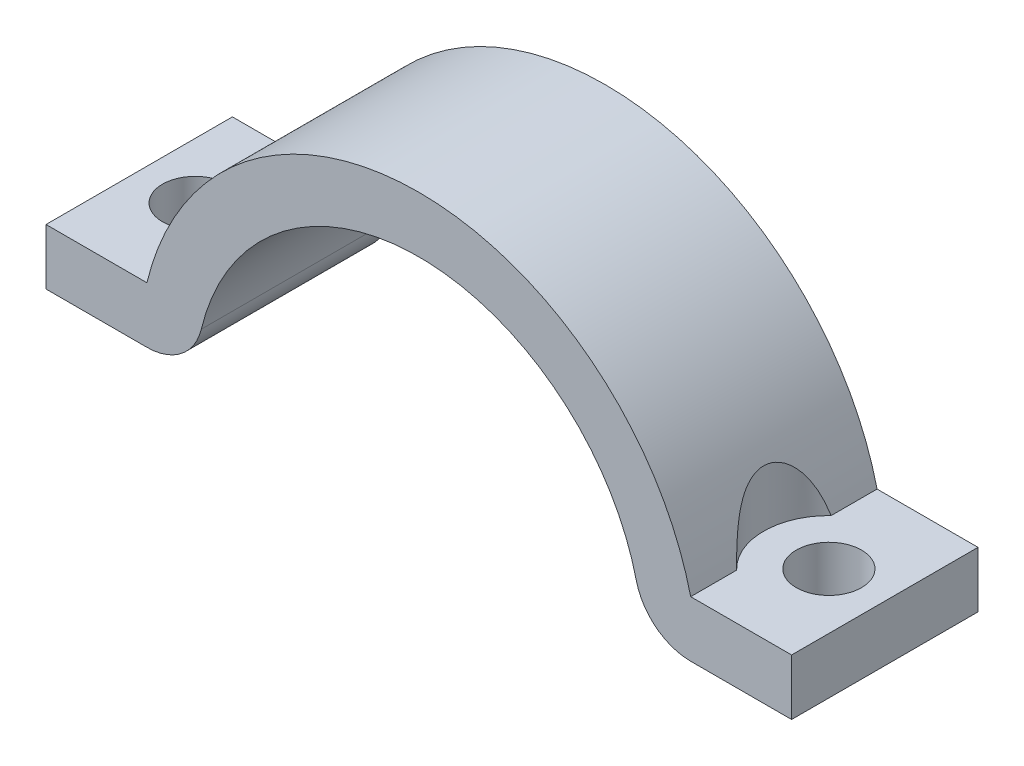
ISO-10303-21;
HEADER;
FILE_DESCRIPTION(('STEP AP214'),'2;1');
FILE_NAME('part.step','',(''),(''),'','','');
FILE_SCHEMA(('AUTOMOTIVE_DESIGN { 1 0 10303 214 1 1 1 1 }'));
ENDSEC;
DATA;
#1=APPLICATION_CONTEXT('core data for automotive mechanical design processes');
#2=APPLICATION_PROTOCOL_DEFINITION('international standard','automotive_design',2000,#1);
#3=PRODUCT_CONTEXT('',#1,'mechanical');
#4=PRODUCT('Part','Part','',(#3));
#5=PRODUCT_RELATED_PRODUCT_CATEGORY('part','',(#4));
#6=PRODUCT_DEFINITION_FORMATION('','',#4);
#7=PRODUCT_DEFINITION_CONTEXT('part definition',#1,'design');
#8=PRODUCT_DEFINITION('design','',#6,#7);
#9=PRODUCT_DEFINITION_SHAPE('','',#8);
#10=(LENGTH_UNIT() NAMED_UNIT(*) SI_UNIT(.MILLI.,.METRE.));
#11=(NAMED_UNIT(*) PLANE_ANGLE_UNIT() SI_UNIT($,.RADIAN.));
#12=(NAMED_UNIT(*) SI_UNIT($,.STERADIAN.) SOLID_ANGLE_UNIT());
#13=UNCERTAINTY_MEASURE_WITH_UNIT(LENGTH_MEASURE(1.E-05),#10,'distance_accuracy_value','');
#14=(GEOMETRIC_REPRESENTATION_CONTEXT(3) GLOBAL_UNCERTAINTY_ASSIGNED_CONTEXT((#13)) GLOBAL_UNIT_ASSIGNED_CONTEXT((#10,
#11,#12)) REPRESENTATION_CONTEXT('',''));
#15=CARTESIAN_POINT('',(0.,0.,0.));
#16=DIRECTION('',(0.,0.,1.));
#17=DIRECTION('',(1.,0.,0.));
#18=AXIS2_PLACEMENT_3D('',#15,#16,#17);
#19=CARTESIAN_POINT('',(0.,0.,10.));
#20=DIRECTION('',(0.,0.,-1.));
#21=DIRECTION('',(-1.,0.,0.));
#22=AXIS2_PLACEMENT_3D('',#19,#20,#21);
#23=CYLINDRICAL_SURFACE('',#22,15.);
#24=CARTESIAN_POINT('',(-14.5859521458148,3.5,7.53424011445323));
#25=CARTESIAN_POINT('',(-14.5649775467469,3.58741775826532,7.51425175867421));
#26=CARTESIAN_POINT('',(-14.5432727234735,3.67439923131074,7.49308765749988));
#27=CARTESIAN_POINT('',(-14.4984766851675,3.84735530322871,7.44814205619525));
#28=CARTESIAN_POINT('',(-14.4753849952336,3.93332954501489,7.42435965713838));
#29=CARTESIAN_POINT('',(-14.4277310130663,4.10469791384236,7.37374138620417));
#30=CARTESIAN_POINT('',(-14.4031592388774,4.19008326148459,7.34688454596669));
#31=CARTESIAN_POINT('',(-14.3528196817546,4.35940071796497,7.28995089651796));
#32=CARTESIAN_POINT('',(-14.3270520242622,4.44333297796141,7.25987442459745));
#33=CARTESIAN_POINT('',(-14.2471933913643,4.69562709684794,7.16314136614727));
#34=CARTESIAN_POINT('',(-14.1914179062184,4.86136628002064,7.09087091867489));
#35=CARTESIAN_POINT('',(-14.0773581012023,5.18235335794898,6.92821747130235));
#36=CARTESIAN_POINT('',(-14.0190830389199,5.33763527527439,6.83789742255875));
#37=CARTESIAN_POINT('',(-13.9421250230572,5.53352301683,6.70318562510968));
#38=CARTESIAN_POINT('',(-13.9231921031473,5.58097160102167,6.66879475832202));
#39=CARTESIAN_POINT('',(-13.8855454985163,5.67398788371715,6.59743700283725));
#40=CARTESIAN_POINT('',(-13.8668318366765,5.71955538714684,6.56046984803404));
#41=CARTESIAN_POINT('',(-13.8113613976594,5.85282064304073,6.44561798658077));
#42=CARTESIAN_POINT('',(-13.7751813640525,5.93731832325999,6.36362323049631));
#43=CARTESIAN_POINT('',(-13.7059113055069,6.09553448526583,6.18664116432745));
#44=CARTESIAN_POINT('',(-13.6728614647396,6.16911827179663,6.09151566827915));
#45=CARTESIAN_POINT('',(-13.6130802522877,6.29993881188515,5.88874230687582));
#46=CARTESIAN_POINT('',(-13.586337273087,6.35720563723386,5.78111799884508));
#47=CARTESIAN_POINT('',(-13.5483579326262,6.43765652431686,5.58583556356696));
#48=CARTESIAN_POINT('',(-13.5348827290333,6.46587303474558,5.50069300863913));
#49=CARTESIAN_POINT('',(-13.5141493687733,6.50909758517251,5.32637728006962));
#50=CARTESIAN_POINT('',(-13.5068862773886,6.52411610951992,5.23720736504056));
#51=CARTESIAN_POINT('',(-13.4992985161214,6.53980301734674,5.05698461950625));
#52=CARTESIAN_POINT('',(-13.4989979965559,6.54042145283832,4.96592633140515));
#53=CARTESIAN_POINT('',(-13.505430061092,6.52712863418413,4.78512949440915));
#54=CARTESIAN_POINT('',(-13.5121643270221,6.5132139055488,4.69539126630763));
#55=CARTESIAN_POINT('',(-13.5315285877553,6.47288158289381,4.52370843565027));
#56=CARTESIAN_POINT('',(-13.5438870351452,6.4470391450871,4.4415946341444));
#57=CARTESIAN_POINT('',(-13.5733808122106,6.38470993663668,4.28247506818655));
#58=CARTESIAN_POINT('',(-13.5905178902685,6.3482192698424,4.20547118611751));
#59=CARTESIAN_POINT('',(-13.63817859789,6.24537403931574,4.01942829547286));
#60=CARTESIAN_POINT('',(-13.6710645338394,6.17329357423353,3.91416469462936));
#61=CARTESIAN_POINT('',(-13.7417712271919,6.01425891024606,3.71744606800628));
#62=CARTESIAN_POINT('',(-13.779603383916,5.92727020446678,3.62602402613253));
#63=CARTESIAN_POINT('',(-13.8497559318648,5.76113819498544,3.47306292427387));
#64=CARTESIAN_POINT('',(-13.8816633635541,5.68391103440222,3.40920556062076));
#65=CARTESIAN_POINT('',(-13.9460385015117,5.5240775856814,3.28886534559357));
#66=CARTESIAN_POINT('',(-13.9785065643639,5.44146777381491,3.23238739931272));
#67=CARTESIAN_POINT('',(-14.0434072489776,5.27171785990915,3.12584303150799));
#68=CARTESIAN_POINT('',(-14.0758391861028,5.18456065508727,3.07580369909909));
#69=CARTESIAN_POINT('',(-14.1400244496469,5.00685923089249,2.98163792851905));
#70=CARTESIAN_POINT('',(-14.1717775932154,4.9163141165237,2.937513067104));
#71=CARTESIAN_POINT('',(-14.2389195159124,4.71864840697213,2.84825446916545));
#72=CARTESIAN_POINT('',(-14.2741348506207,4.61108658134921,2.80397121741455));
#73=CARTESIAN_POINT('',(-14.3427328657938,4.39307257498353,2.72144647580999));
#74=CARTESIAN_POINT('',(-14.376114887614,4.28261937624581,2.68320714817855));
#75=CARTESIAN_POINT('',(-14.440243428642,4.06109063238483,2.61255442645187));
#76=CARTESIAN_POINT('',(-14.4710219503536,3.95004922849364,2.58006230182764));
#77=CARTESIAN_POINT('',(-14.5302628740465,3.7262440475591,2.51964722812827));
#78=CARTESIAN_POINT('',(-14.5587275710955,3.61348211232151,2.49171972293744));
#79=CARTESIAN_POINT('',(-14.5859521458148,3.50000000000001,2.46575988554674));
#80=B_SPLINE_CURVE_WITH_KNOTS('',3,(#24,#25,#26,#27,#28,#29,#30,#31,#32,#33,#34,#35,#36,#37,#38,
#39,#40,#41,#42,#43,#44,#45,#46,#47,#48,#49,#50,#51,#52,#53,#54,#55,#56,#57,#58,#59,#60,#61,#62,
#63,#64,#65,#66,#67,#68,#69,#70,#71,#72,#73,#74,#75,#76,#77,#78,#79),.UNSPECIFIED.,.F.,.F.,(4,2,
2,2,2,2,2,2,2,2,2,2,2,2,2,2,2,2,2,2,2,2,2,2,2,2,2,4),(0.,0.276281437916817,0.552658027655493,
0.83104658864796,1.10940601395965,1.67616938670308,2.2409895271761,2.42567034295721,
2.61037026286704,2.97887209856077,3.3515989481878,3.7236343605592,3.99463160395806,
4.26541337472301,4.53713423673524,4.80892007478704,5.06878513289519,5.32874539422062,
5.72175691291057,6.11569070172868,6.43075483224817,6.74602733167086,7.0625856813575,
7.37922825611957,7.74359981573351,8.10810143615745,8.46713978749402,8.82581755144547),.UNSPECIFIED.);
#81=CARTESIAN_POINT('',(-14.5859521458148,3.5,7.53424011445323));
#82=VERTEX_POINT('',#81);
#83=CARTESIAN_POINT('',(-14.5859521458148,3.5,2.46575988554677));
#84=VERTEX_POINT('',#83);
#85=EDGE_CURVE('E247',#82,#84,#80,.T.);
#86=ORIENTED_EDGE('',*,*,#85,.F.);
#87=DIRECTION('',(0.,0.,-1.));
#88=VECTOR('',#87,1.);
#89=CARTESIAN_POINT('',(-14.5859521458148,3.5,10.));
#90=LINE('',#89,#88);
#91=CARTESIAN_POINT('',(-14.5859521458148,3.5,10.));
#92=VERTEX_POINT('',#91);
#93=EDGE_CURVE('E142',#92,#82,#90,.T.);
#94=ORIENTED_EDGE('',*,*,#93,.F.);
#95=CARTESIAN_POINT('',(0.,0.,10.));
#96=DIRECTION('',(0.,0.,1.));
#97=DIRECTION('',(1.,0.,0.));
#98=AXIS2_PLACEMENT_3D('',#95,#96,#97);
#99=CIRCLE('',#98,15.);
#100=CARTESIAN_POINT('',(14.5859521458148,3.5,10.));
#101=VERTEX_POINT('',#100);
#102=EDGE_CURVE('E235',#101,#92,#99,.T.);
#103=ORIENTED_EDGE('',*,*,#102,.F.);
#104=DIRECTION('',(0.,0.,-1.));
#105=VECTOR('',#104,1.);
#106=CARTESIAN_POINT('',(14.5859521458148,3.5,10.));
#107=LINE('',#106,#105);
#108=CARTESIAN_POINT('',(14.5859521458148,3.5,7.53424011445323));
#109=VERTEX_POINT('',#108);
#110=EDGE_CURVE('E136',#101,#109,#107,.T.);
#111=ORIENTED_EDGE('',*,*,#110,.T.);
#112=CARTESIAN_POINT('',(14.5859521458148,3.5,2.46575988554677));
#113=CARTESIAN_POINT('',(14.5649775467468,3.58741775826532,2.48574824132579));
#114=CARTESIAN_POINT('',(14.5432727234735,3.67439923131074,2.50691234250012));
#115=CARTESIAN_POINT('',(14.4984766851675,3.84735530322871,2.55185794380475));
#116=CARTESIAN_POINT('',(14.4753849952336,3.93332954501489,2.57564034286162));
#117=CARTESIAN_POINT('',(14.4277310130663,4.10469791384236,2.62625861379582));
#118=CARTESIAN_POINT('',(14.4031592388774,4.19008326148458,2.65311545403331));
#119=CARTESIAN_POINT('',(14.3528196817546,4.35940071796497,2.71004910348203));
#120=CARTESIAN_POINT('',(14.3270520242622,4.44333297796141,2.74012557540255));
#121=CARTESIAN_POINT('',(14.2471933913643,4.69562709684794,2.83685863385273));
#122=CARTESIAN_POINT('',(14.1914179062184,4.86136628002063,2.90912908132512));
#123=CARTESIAN_POINT('',(14.0773581012023,5.18235335794898,3.07178252869765));
#124=CARTESIAN_POINT('',(14.0190830389199,5.33763527527439,3.16210257744126));
#125=CARTESIAN_POINT('',(13.9421250230572,5.53352301683,3.29681437489033));
#126=CARTESIAN_POINT('',(13.9231921031473,5.58097160102167,3.33120524167798));
#127=CARTESIAN_POINT('',(13.8855454985163,5.67398788371715,3.40256299716275));
#128=CARTESIAN_POINT('',(13.8668318366765,5.71955538714684,3.43953015196596));
#129=CARTESIAN_POINT('',(13.8113613976594,5.85282064304073,3.55438201341923));
#130=CARTESIAN_POINT('',(13.7751813640525,5.93731832326,3.63637676950369));
#131=CARTESIAN_POINT('',(13.7059113055069,6.09553448526584,3.81335883567255));
#132=CARTESIAN_POINT('',(13.6728614647396,6.16911827179663,3.90848433172086));
#133=CARTESIAN_POINT('',(13.6130802522877,6.29993881188515,4.11125769312419));
#134=CARTESIAN_POINT('',(13.586337273087,6.35720563723386,4.21888200115493));
#135=CARTESIAN_POINT('',(13.5483579326262,6.43765652431686,4.41416443643305));
#136=CARTESIAN_POINT('',(13.5348827290333,6.46587303474558,4.49930699136088));
#137=CARTESIAN_POINT('',(13.5141493687733,6.50909758517251,4.67362271993038));
#138=CARTESIAN_POINT('',(13.5068862773886,6.52411610951992,4.76279263495945));
#139=CARTESIAN_POINT('',(13.4992985161214,6.53980301734674,4.94301538049375));
#140=CARTESIAN_POINT('',(13.4989979965559,6.54042145283833,5.03407366859486));
#141=CARTESIAN_POINT('',(13.505430061092,6.52712863418413,5.21487050559086));
#142=CARTESIAN_POINT('',(13.5121643270221,6.5132139055488,5.30460873369238));
#143=CARTESIAN_POINT('',(13.5315285877553,6.47288158289381,5.47629156434974));
#144=CARTESIAN_POINT('',(13.5438870351452,6.4470391450871,5.55840536585561));
#145=CARTESIAN_POINT('',(13.5733808122106,6.38470993663667,5.71752493181345));
#146=CARTESIAN_POINT('',(13.5905178902685,6.3482192698424,5.7945288138825));
#147=CARTESIAN_POINT('',(13.63817859789,6.24537403931574,5.98057170452715));
#148=CARTESIAN_POINT('',(13.6710645338394,6.17329357423353,6.08583530537065));
#149=CARTESIAN_POINT('',(13.7417712271919,6.01425891024606,6.28255393199372));
#150=CARTESIAN_POINT('',(13.7796033839161,5.92727020446677,6.37397597386747));
#151=CARTESIAN_POINT('',(13.8497559318648,5.76113819498543,6.52693707572614));
#152=CARTESIAN_POINT('',(13.8816633635541,5.68391103440221,6.59079443937924));
#153=CARTESIAN_POINT('',(13.9460385015117,5.52407758568139,6.71113465440644));
#154=CARTESIAN_POINT('',(13.9785065643639,5.4414677738149,6.76761260068728));
#155=CARTESIAN_POINT('',(14.0434072489776,5.27171785990914,6.87415696849202));
#156=CARTESIAN_POINT('',(14.0758391861028,5.18456065508726,6.92419630090091));
#157=CARTESIAN_POINT('',(14.1400244496469,5.00685923089248,7.01836207148096));
#158=CARTESIAN_POINT('',(14.1717775932154,4.91631411652369,7.062486932896));
#159=CARTESIAN_POINT('',(14.2389195159124,4.71864840697211,7.15174553083455));
#160=CARTESIAN_POINT('',(14.2741348506207,4.6110865813492,7.19602878258546));
#161=CARTESIAN_POINT('',(14.3427328657938,4.39307257498352,7.27855352419001));
#162=CARTESIAN_POINT('',(14.376114887614,4.2826193762458,7.31679285182145));
#163=CARTESIAN_POINT('',(14.440243428642,4.06109063238482,7.38744557354813));
#164=CARTESIAN_POINT('',(14.4710219503536,3.95004922849364,7.41993769817236));
#165=CARTESIAN_POINT('',(14.5302628740465,3.72624404755909,7.48035277187174));
#166=CARTESIAN_POINT('',(14.5587275710955,3.61348211232151,7.50828027706257));
#167=CARTESIAN_POINT('',(14.5859521458148,3.50000000000001,7.53424011445326));
#168=B_SPLINE_CURVE_WITH_KNOTS('',3,(#112,#113,#114,#115,#116,#117,#118,#119,#120,#121,#122,
#123,#124,#125,#126,#127,#128,#129,#130,#131,#132,#133,#134,#135,#136,#137,#138,#139,#140,#141,
#142,#143,#144,#145,#146,#147,#148,#149,#150,#151,#152,#153,#154,#155,#156,#157,#158,#159,#160,
#161,#162,#163,#164,#165,#166,#167),.UNSPECIFIED.,.F.,.F.,(4,2,2,2,2,2,2,2,2,2,2,2,2,2,2,2,2,2,
2,2,2,2,2,2,2,2,2,4),(0.,0.276281437916815,0.552658027655489,0.831046588647957,1.10940601395964,
1.67616938670308,2.2409895271761,2.42567034295721,2.61037026286704,2.97887209856078,
3.35159894818781,3.7236343605592,3.99463160395807,4.26541337472302,4.53713423673524,
4.80892007478704,5.0687851328952,5.32874539422063,5.72175691291058,6.11569070172869,
6.43075483224818,6.74602733167088,7.06258568135752,7.37922825611959,7.74359981573352,
8.10810143615746,8.46713978749403,8.82581755144547),.UNSPECIFIED.);
#169=CARTESIAN_POINT('',(14.5859521458148,3.5,2.46575988554677));
#170=VERTEX_POINT('',#169);
#171=EDGE_CURVE('E11',#170,#109,#168,.T.);
#172=ORIENTED_EDGE('',*,*,#171,.F.);
#173=CARTESIAN_POINT('',(14.5859521458148,3.5,0.));
#174=VERTEX_POINT('',#173);
#175=EDGE_CURVE('E133',#170,#174,#107,.T.);
#176=ORIENTED_EDGE('',*,*,#175,.T.);
#177=CARTESIAN_POINT('',(0.,0.,0.));
#178=DIRECTION('',(0.,0.,1.));
#179=DIRECTION('',(1.,0.,0.));
#180=AXIS2_PLACEMENT_3D('',#177,#178,#179);
#181=CIRCLE('',#180,15.);
#182=CARTESIAN_POINT('',(-14.5859521458148,3.5,0.));
#183=VERTEX_POINT('',#182);
#184=EDGE_CURVE('E184',#174,#183,#181,.T.);
#185=ORIENTED_EDGE('',*,*,#184,.T.);
#186=EDGE_CURVE('E145',#84,#183,#90,.T.);
#187=ORIENTED_EDGE('',*,*,#186,.F.);
#188=EDGE_LOOP('',(#86,#94,#103,#111,#172,#176,#185,#187));
#189=FACE_BOUND('',#188,.T.);
#190=ADVANCED_FACE('F33',(#189),#23,.T.);
#191=CARTESIAN_POINT('',(14.5859521458148,3.5,10.));
#192=DIRECTION('',(0.,0.,-1.));
#193=DIRECTION('',(-1.,0.,0.));
#194=AXIS2_PLACEMENT_3D('',#191,#192,#193);
#195=CYLINDRICAL_SURFACE('',#194,3.);
#196=CARTESIAN_POINT('',(14.5859521458148,3.5,0.));
#197=DIRECTION('',(0.,0.,1.));
#198=DIRECTION('',(-1.,0.,0.));
#199=AXIS2_PLACEMENT_3D('',#196,#197,#198);
#200=CIRCLE('',#199,3.);
#201=CARTESIAN_POINT('',(11.6687617166519,2.8,0.));
#202=VERTEX_POINT('',#201);
#203=CARTESIAN_POINT('',(14.5859521458148,0.5,0.));
#204=VERTEX_POINT('',#203);
#205=EDGE_CURVE('E165',#202,#204,#200,.T.);
#206=ORIENTED_EDGE('',*,*,#205,.T.);
#207=DIRECTION('',(0.,0.,-1.));
#208=VECTOR('',#207,1.);
#209=CARTESIAN_POINT('',(14.5859521458148,0.5,10.));
#210=LINE('',#209,#208);
#211=CARTESIAN_POINT('',(14.5859521458148,0.5,10.));
#212=VERTEX_POINT('',#211);
#213=EDGE_CURVE('E47',#212,#204,#210,.T.);
#214=ORIENTED_EDGE('',*,*,#213,.F.);
#215=CARTESIAN_POINT('',(14.5859521458148,3.5,10.));
#216=DIRECTION('',(0.,0.,1.));
#217=DIRECTION('',(-1.,0.,0.));
#218=AXIS2_PLACEMENT_3D('',#215,#216,#217);
#219=CIRCLE('',#218,3.);
#220=CARTESIAN_POINT('',(11.6687617166519,2.8,10.));
#221=VERTEX_POINT('',#220);
#222=EDGE_CURVE('E197',#221,#212,#219,.T.);
#223=ORIENTED_EDGE('',*,*,#222,.F.);
#224=DIRECTION('',(0.,0.,-1.));
#225=VECTOR('',#224,1.);
#226=CARTESIAN_POINT('',(11.6687617166519,2.8,10.));
#227=LINE('',#226,#225);
#228=EDGE_CURVE('E167',#221,#202,#227,.T.);
#229=ORIENTED_EDGE('',*,*,#228,.T.);
#230=EDGE_LOOP('',(#206,#214,#223,#229));
#231=FACE_BOUND('',#230,.T.);
#232=ADVANCED_FACE('F35',(#231),#195,.T.);
#233=CARTESIAN_POINT('',(14.5859521458148,0.5,10.));
#234=DIRECTION('',(0.,1.,0.));
#235=DIRECTION('',(0.,0.,1.));
#236=AXIS2_PLACEMENT_3D('',#233,#234,#235);
#237=PLANE('',#236);
#238=CARTESIAN_POINT('',(17.,0.499999999999999,5.));
#239=DIRECTION('',(0.,1.,0.));
#240=DIRECTION('',(0.,0.,1.));
#241=AXIS2_PLACEMENT_3D('',#238,#239,#240);
#242=CIRCLE('',#241,1.75);
#243=CARTESIAN_POINT('',(17.,0.499999999999999,6.75));
#244=VERTEX_POINT('',#243);
#245=EDGE_CURVE('E246',#244,#244,#242,.T.);
#246=ORIENTED_EDGE('',*,*,#245,.T.);
#247=EDGE_LOOP('',(#246));
#248=FACE_BOUND('',#247,.T.);
#249=DIRECTION('',(1.,0.,0.));
#250=VECTOR('',#249,1.);
#251=CARTESIAN_POINT('',(14.5859521458148,0.5,0.));
#252=LINE('',#251,#250);
#253=CARTESIAN_POINT('',(20.,0.5,0.));
#254=VERTEX_POINT('',#253);
#255=EDGE_CURVE('E158',#204,#254,#252,.T.);
#256=ORIENTED_EDGE('',*,*,#255,.T.);
#257=DIRECTION('',(0.,0.,-1.));
#258=VECTOR('',#257,1.);
#259=CARTESIAN_POINT('',(20.,0.5,10.));
#260=LINE('',#259,#258);
#261=CARTESIAN_POINT('',(20.,0.5,10.));
#262=VERTEX_POINT('',#261);
#263=EDGE_CURVE('E150',#262,#254,#260,.T.);
#264=ORIENTED_EDGE('',*,*,#263,.F.);
#265=DIRECTION('',(1.,0.,0.));
#266=VECTOR('',#265,1.);
#267=CARTESIAN_POINT('',(14.5859521458148,0.5,10.));
#268=LINE('',#267,#266);
#269=EDGE_CURVE('E159',#212,#262,#268,.T.);
#270=ORIENTED_EDGE('',*,*,#269,.F.);
#271=ORIENTED_EDGE('',*,*,#213,.T.);
#272=EDGE_LOOP('',(#256,#264,#270,#271));
#273=FACE_BOUND('',#272,.T.);
#274=ADVANCED_FACE('F156',(#248,#273),#237,.F.);
#275=CARTESIAN_POINT('',(20.,0.5,10.));
#276=DIRECTION('',(-1.,0.,0.));
#277=DIRECTION('',(0.,0.,1.));
#278=AXIS2_PLACEMENT_3D('',#275,#276,#277);
#279=PLANE('',#278);
#280=DIRECTION('',(0.,1.,0.));
#281=VECTOR('',#280,1.);
#282=CARTESIAN_POINT('',(20.,0.5,0.));
#283=LINE('',#282,#281);
#284=CARTESIAN_POINT('',(20.,3.5,0.));
#285=VERTEX_POINT('',#284);
#286=EDGE_CURVE('E172',#254,#285,#283,.T.);
#287=ORIENTED_EDGE('',*,*,#286,.T.);
#288=DIRECTION('',(0.,0.,-1.));
#289=VECTOR('',#288,1.);
#290=CARTESIAN_POINT('',(20.,3.5,10.));
#291=LINE('',#290,#289);
#292=CARTESIAN_POINT('',(20.,3.5,10.));
#293=VERTEX_POINT('',#292);
#294=EDGE_CURVE('E144',#293,#285,#291,.T.);
#295=ORIENTED_EDGE('',*,*,#294,.F.);
#296=DIRECTION('',(0.,1.,0.));
#297=VECTOR('',#296,1.);
#298=CARTESIAN_POINT('',(20.,0.5,10.));
#299=LINE('',#298,#297);
#300=EDGE_CURVE('E239',#262,#293,#299,.T.);
#301=ORIENTED_EDGE('',*,*,#300,.F.);
#302=ORIENTED_EDGE('',*,*,#263,.T.);
#303=EDGE_LOOP('',(#287,#295,#301,#302));
#304=FACE_BOUND('',#303,.T.);
#305=ADVANCED_FACE('F297',(#304),#279,.F.);
#306=CARTESIAN_POINT('',(20.,3.5,10.));
#307=DIRECTION('',(0.,-1.,0.));
#308=DIRECTION('',(0.,0.,-1.));
#309=AXIS2_PLACEMENT_3D('',#306,#307,#308);
#310=PLANE('',#309);
#311=ORIENTED_EDGE('',*,*,#175,.F.);
#312=CARTESIAN_POINT('',(17.,3.5,5.));
#313=DIRECTION('',(0.,1.,0.));
#314=DIRECTION('',(0.,0.,1.));
#315=AXIS2_PLACEMENT_3D('',#312,#313,#314);
#316=CIRCLE('',#315,3.5);
#317=EDGE_CURVE('E54',#170,#109,#316,.T.);
#318=ORIENTED_EDGE('',*,*,#317,.T.);
#319=ORIENTED_EDGE('',*,*,#110,.F.);
#320=DIRECTION('',(-1.,0.,0.));
#321=VECTOR('',#320,1.);
#322=CARTESIAN_POINT('',(20.,3.5,10.));
#323=LINE('',#322,#321);
#324=EDGE_CURVE('E237',#293,#101,#323,.T.);
#325=ORIENTED_EDGE('',*,*,#324,.F.);
#326=ORIENTED_EDGE('',*,*,#294,.T.);
#327=DIRECTION('',(-1.,0.,0.));
#328=VECTOR('',#327,1.);
#329=CARTESIAN_POINT('',(20.,3.5,0.));
#330=LINE('',#329,#328);
#331=EDGE_CURVE('E140',#285,#174,#330,.T.);
#332=ORIENTED_EDGE('',*,*,#331,.T.);
#333=EDGE_LOOP('',(#311,#318,#319,#325,#326,#332));
#334=FACE_BOUND('',#333,.T.);
#335=CARTESIAN_POINT('',(17.,3.5,5.));
#336=DIRECTION('',(0.,1.,0.));
#337=DIRECTION('',(0.,0.,1.));
#338=AXIS2_PLACEMENT_3D('',#335,#336,#337);
#339=CIRCLE('',#338,1.75);
#340=CARTESIAN_POINT('',(17.,3.5,6.75));
#341=VERTEX_POINT('',#340);
#342=EDGE_CURVE('E243',#341,#341,#339,.T.);
#343=ORIENTED_EDGE('',*,*,#342,.F.);
#344=EDGE_LOOP('',(#343));
#345=FACE_BOUND('',#344,.T.);
#346=ADVANCED_FACE('F137',(#334,#345),#310,.F.);
#347=CARTESIAN_POINT('',(-20.,3.5,10.));
#348=DIRECTION('',(0.,-1.,0.));
#349=DIRECTION('',(0.,0.,-1.));
#350=AXIS2_PLACEMENT_3D('',#347,#348,#349);
#351=PLANE('',#350);
#352=DIRECTION('',(-1.,0.,0.));
#353=VECTOR('',#352,1.);
#354=CARTESIAN_POINT('',(-20.,3.5,0.));
#355=LINE('',#354,#353);
#356=CARTESIAN_POINT('',(-20.,3.5,0.));
#357=VERTEX_POINT('',#356);
#358=EDGE_CURVE('E186',#183,#357,#355,.T.);
#359=ORIENTED_EDGE('',*,*,#358,.T.);
#360=DIRECTION('',(0.,0.,-1.));
#361=VECTOR('',#360,1.);
#362=CARTESIAN_POINT('',(-20.,3.5,10.));
#363=LINE('',#362,#361);
#364=CARTESIAN_POINT('',(-20.,3.5,10.));
#365=VERTEX_POINT('',#364);
#366=EDGE_CURVE('E207',#365,#357,#363,.T.);
#367=ORIENTED_EDGE('',*,*,#366,.F.);
#368=DIRECTION('',(-1.,0.,0.));
#369=VECTOR('',#368,1.);
#370=CARTESIAN_POINT('',(-20.,3.5,10.));
#371=LINE('',#370,#369);
#372=EDGE_CURVE('E231',#92,#365,#371,.T.);
#373=ORIENTED_EDGE('',*,*,#372,.F.);
#374=ORIENTED_EDGE('',*,*,#93,.T.);
#375=CARTESIAN_POINT('',(-17.,3.5,5.));
#376=DIRECTION('',(0.,1.,0.));
#377=DIRECTION('',(0.,0.,1.));
#378=AXIS2_PLACEMENT_3D('',#375,#376,#377);
#379=CIRCLE('',#378,3.5);
#380=EDGE_CURVE('E61',#82,#84,#379,.T.);
#381=ORIENTED_EDGE('',*,*,#380,.T.);
#382=ORIENTED_EDGE('',*,*,#186,.T.);
#383=EDGE_LOOP('',(#359,#367,#373,#374,#381,#382));
#384=FACE_BOUND('',#383,.T.);
#385=CARTESIAN_POINT('',(-17.,3.5,5.));
#386=DIRECTION('',(0.,1.,0.));
#387=DIRECTION('',(0.,0.,1.));
#388=AXIS2_PLACEMENT_3D('',#385,#386,#387);
#389=CIRCLE('',#388,1.75);
#390=CARTESIAN_POINT('',(-17.,3.5,6.75));
#391=VERTEX_POINT('',#390);
#392=EDGE_CURVE('E175',#391,#391,#389,.T.);
#393=ORIENTED_EDGE('',*,*,#392,.F.);
#394=EDGE_LOOP('',(#393));
#395=FACE_BOUND('',#394,.T.);
#396=ADVANCED_FACE('F212',(#384,#395),#351,.F.);
#397=CARTESIAN_POINT('',(-20.,0.5,10.));
#398=DIRECTION('',(1.,0.,0.));
#399=DIRECTION('',(0.,0.,-1.));
#400=AXIS2_PLACEMENT_3D('',#397,#398,#399);
#401=PLANE('',#400);
#402=DIRECTION('',(0.,-1.,0.));
#403=VECTOR('',#402,1.);
#404=CARTESIAN_POINT('',(-20.,0.5,0.));
#405=LINE('',#404,#403);
#406=CARTESIAN_POINT('',(-20.,0.5,0.));
#407=VERTEX_POINT('',#406);
#408=EDGE_CURVE('E189',#357,#407,#405,.T.);
#409=ORIENTED_EDGE('',*,*,#408,.T.);
#410=DIRECTION('',(0.,0.,-1.));
#411=VECTOR('',#410,1.);
#412=CARTESIAN_POINT('',(-20.,0.5,10.));
#413=LINE('',#412,#411);
#414=CARTESIAN_POINT('',(-20.,0.5,10.));
#415=VERTEX_POINT('',#414);
#416=EDGE_CURVE('E205',#415,#407,#413,.T.);
#417=ORIENTED_EDGE('',*,*,#416,.F.);
#418=DIRECTION('',(0.,-1.,0.));
#419=VECTOR('',#418,1.);
#420=CARTESIAN_POINT('',(-20.,0.5,10.));
#421=LINE('',#420,#419);
#422=EDGE_CURVE('E229',#365,#415,#421,.T.);
#423=ORIENTED_EDGE('',*,*,#422,.F.);
#424=ORIENTED_EDGE('',*,*,#366,.T.);
#425=EDGE_LOOP('',(#409,#417,#423,#424));
#426=FACE_BOUND('',#425,.T.);
#427=ADVANCED_FACE('F220',(#426),#401,.F.);
#428=CARTESIAN_POINT('',(-20.,0.5,10.));
#429=DIRECTION('',(0.,1.,0.));
#430=DIRECTION('',(0.,0.,1.));
#431=AXIS2_PLACEMENT_3D('',#428,#429,#430);
#432=PLANE('',#431);
#433=CARTESIAN_POINT('',(-17.,0.499999999999999,5.));
#434=DIRECTION('',(0.,1.,0.));
#435=DIRECTION('',(0.,0.,1.));
#436=AXIS2_PLACEMENT_3D('',#433,#434,#435);
#437=CIRCLE('',#436,1.75);
#438=CARTESIAN_POINT('',(-17.,0.499999999999999,6.75));
#439=VERTEX_POINT('',#438);
#440=EDGE_CURVE('E170',#439,#439,#437,.T.);
#441=ORIENTED_EDGE('',*,*,#440,.T.);
#442=EDGE_LOOP('',(#441));
#443=FACE_BOUND('',#442,.T.);
#444=DIRECTION('',(1.,0.,0.));
#445=VECTOR('',#444,1.);
#446=CARTESIAN_POINT('',(-20.,0.5,0.));
#447=LINE('',#446,#445);
#448=CARTESIAN_POINT('',(-14.5859521458148,0.5,0.));
#449=VERTEX_POINT('',#448);
#450=EDGE_CURVE('E191',#407,#449,#447,.T.);
#451=ORIENTED_EDGE('',*,*,#450,.T.);
#452=DIRECTION('',(0.,0.,-1.));
#453=VECTOR('',#452,1.);
#454=CARTESIAN_POINT('',(-14.5859521458148,0.5,10.));
#455=LINE('',#454,#453);
#456=CARTESIAN_POINT('',(-14.5859521458148,0.5,10.));
#457=VERTEX_POINT('',#456);
#458=EDGE_CURVE('E202',#457,#449,#455,.T.);
#459=ORIENTED_EDGE('',*,*,#458,.F.);
#460=DIRECTION('',(1.,0.,0.));
#461=VECTOR('',#460,1.);
#462=CARTESIAN_POINT('',(-20.,0.5,10.));
#463=LINE('',#462,#461);
#464=EDGE_CURVE('E225',#415,#457,#463,.T.);
#465=ORIENTED_EDGE('',*,*,#464,.F.);
#466=ORIENTED_EDGE('',*,*,#416,.T.);
#467=EDGE_LOOP('',(#451,#459,#465,#466));
#468=FACE_BOUND('',#467,.T.);
#469=ADVANCED_FACE('F223',(#443,#468),#432,.F.);
#470=CARTESIAN_POINT('',(-14.5859521458148,3.5,10.));
#471=DIRECTION('',(0.,0.,-1.));
#472=DIRECTION('',(-1.,0.,0.));
#473=AXIS2_PLACEMENT_3D('',#470,#471,#472);
#474=CYLINDRICAL_SURFACE('',#473,3.);
#475=CARTESIAN_POINT('',(-14.5859521458148,3.5,0.));
#476=DIRECTION('',(0.,0.,1.));
#477=DIRECTION('',(-1.,0.,0.));
#478=AXIS2_PLACEMENT_3D('',#475,#476,#477);
#479=CIRCLE('',#478,3.);
#480=CARTESIAN_POINT('',(-11.6687617166519,2.8,0.));
#481=VERTEX_POINT('',#480);
#482=EDGE_CURVE('E193',#449,#481,#479,.T.);
#483=ORIENTED_EDGE('',*,*,#482,.T.);
#484=DIRECTION('',(0.,0.,-1.));
#485=VECTOR('',#484,1.);
#486=CARTESIAN_POINT('',(-11.6687617166519,2.8,10.));
#487=LINE('',#486,#485);
#488=CARTESIAN_POINT('',(-11.6687617166519,2.8,10.));
#489=VERTEX_POINT('',#488);
#490=EDGE_CURVE('E199',#489,#481,#487,.T.);
#491=ORIENTED_EDGE('',*,*,#490,.F.);
#492=CARTESIAN_POINT('',(-14.5859521458148,3.5,10.));
#493=DIRECTION('',(0.,0.,1.));
#494=DIRECTION('',(-1.,0.,0.));
#495=AXIS2_PLACEMENT_3D('',#492,#493,#494);
#496=CIRCLE('',#495,3.);
#497=EDGE_CURVE('E228',#457,#489,#496,.T.);
#498=ORIENTED_EDGE('',*,*,#497,.F.);
#499=ORIENTED_EDGE('',*,*,#458,.T.);
#500=EDGE_LOOP('',(#483,#491,#498,#499));
#501=FACE_BOUND('',#500,.T.);
#502=ADVANCED_FACE('F284',(#501),#474,.T.);
#503=CARTESIAN_POINT('',(0.,0.,10.));
#504=DIRECTION('',(0.,0.,-1.));
#505=DIRECTION('',(-1.,0.,0.));
#506=AXIS2_PLACEMENT_3D('',#503,#504,#505);
#507=CYLINDRICAL_SURFACE('',#506,12.);
#508=CARTESIAN_POINT('',(0.,0.,0.));
#509=DIRECTION('',(0.,0.,-1.));
#510=DIRECTION('',(1.,0.,0.));
#511=AXIS2_PLACEMENT_3D('',#508,#509,#510);
#512=CIRCLE('',#511,12.);
#513=EDGE_CURVE('E195',#481,#202,#512,.T.);
#514=ORIENTED_EDGE('',*,*,#513,.T.);
#515=ORIENTED_EDGE('',*,*,#228,.F.);
#516=CARTESIAN_POINT('',(0.,0.,10.));
#517=DIRECTION('',(0.,0.,-1.));
#518=DIRECTION('',(1.,0.,0.));
#519=AXIS2_PLACEMENT_3D('',#516,#517,#518);
#520=CIRCLE('',#519,12.);
#521=EDGE_CURVE('E178',#489,#221,#520,.T.);
#522=ORIENTED_EDGE('',*,*,#521,.F.);
#523=ORIENTED_EDGE('',*,*,#490,.T.);
#524=EDGE_LOOP('',(#514,#515,#522,#523));
#525=FACE_BOUND('',#524,.T.);
#526=ADVANCED_FACE('F279',(#525),#507,.F.);
#527=CARTESIAN_POINT('',(14.5859521458148,3.5,10.));
#528=DIRECTION('',(0.,0.,-1.));
#529=DIRECTION('',(-1.,0.,0.));
#530=AXIS2_PLACEMENT_3D('',#527,#528,#529);
#531=PLANE('',#530);
#532=ORIENTED_EDGE('',*,*,#222,.T.);
#533=ORIENTED_EDGE('',*,*,#269,.T.);
#534=ORIENTED_EDGE('',*,*,#300,.T.);
#535=ORIENTED_EDGE('',*,*,#324,.T.);
#536=ORIENTED_EDGE('',*,*,#102,.T.);
#537=ORIENTED_EDGE('',*,*,#372,.T.);
#538=ORIENTED_EDGE('',*,*,#422,.T.);
#539=ORIENTED_EDGE('',*,*,#464,.T.);
#540=ORIENTED_EDGE('',*,*,#497,.T.);
#541=ORIENTED_EDGE('',*,*,#521,.T.);
#542=EDGE_LOOP('',(#532,#533,#534,#535,#536,#537,#538,#539,#540,#541));
#543=FACE_BOUND('',#542,.T.);
#544=ADVANCED_FACE('F276',(#543),#531,.F.);
#545=CARTESIAN_POINT('',(14.5859521458148,3.5,0.));
#546=DIRECTION('',(0.,0.,-1.));
#547=DIRECTION('',(-1.,0.,0.));
#548=AXIS2_PLACEMENT_3D('',#545,#546,#547);
#549=PLANE('',#548);
#550=ORIENTED_EDGE('',*,*,#205,.F.);
#551=ORIENTED_EDGE('',*,*,#513,.F.);
#552=ORIENTED_EDGE('',*,*,#482,.F.);
#553=ORIENTED_EDGE('',*,*,#450,.F.);
#554=ORIENTED_EDGE('',*,*,#408,.F.);
#555=ORIENTED_EDGE('',*,*,#358,.F.);
#556=ORIENTED_EDGE('',*,*,#184,.F.);
#557=ORIENTED_EDGE('',*,*,#331,.F.);
#558=ORIENTED_EDGE('',*,*,#286,.F.);
#559=ORIENTED_EDGE('',*,*,#255,.F.);
#560=EDGE_LOOP('',(#550,#551,#552,#553,#554,#555,#556,#557,#558,#559));
#561=FACE_BOUND('',#560,.T.);
#562=ADVANCED_FACE('F216',(#561),#549,.T.);
#563=CARTESIAN_POINT('',(-17.,0.499999999999999,5.));
#564=DIRECTION('',(0.,1.,0.));
#565=DIRECTION('',(0.,0.,1.));
#566=AXIS2_PLACEMENT_3D('',#563,#564,#565);
#567=CYLINDRICAL_SURFACE('',#566,1.75);
#568=ORIENTED_EDGE('',*,*,#440,.F.);
#569=EDGE_LOOP('',(#568));
#570=FACE_BOUND('',#569,.T.);
#571=ORIENTED_EDGE('',*,*,#392,.T.);
#572=EDGE_LOOP('',(#571));
#573=FACE_BOUND('',#572,.T.);
#574=ADVANCED_FACE('F269',(#570,#573),#567,.F.);
#575=CARTESIAN_POINT('',(17.,0.499999999999999,5.));
#576=DIRECTION('',(0.,1.,0.));
#577=DIRECTION('',(0.,0.,1.));
#578=AXIS2_PLACEMENT_3D('',#575,#576,#577);
#579=CYLINDRICAL_SURFACE('',#578,1.75);
#580=ORIENTED_EDGE('',*,*,#245,.F.);
#581=EDGE_LOOP('',(#580));
#582=FACE_BOUND('',#581,.T.);
#583=ORIENTED_EDGE('',*,*,#342,.T.);
#584=EDGE_LOOP('',(#583));
#585=FACE_BOUND('',#584,.T.);
#586=ADVANCED_FACE('F268',(#582,#585),#579,.F.);
#587=CARTESIAN_POINT('',(17.,15.,5.));
#588=DIRECTION('',(0.,-1.,0.));
#589=DIRECTION('',(0.,0.,-1.));
#590=AXIS2_PLACEMENT_3D('',#587,#588,#589);
#591=CYLINDRICAL_SURFACE('',#590,3.5);
#592=ORIENTED_EDGE('',*,*,#171,.T.);
#593=ORIENTED_EDGE('',*,*,#317,.F.);
#594=EDGE_LOOP('',(#592,#593));
#595=FACE_BOUND('',#594,.T.);
#596=ADVANCED_FACE('F127',(#595),#591,.F.);
#597=CARTESIAN_POINT('',(-17.,15.,5.));
#598=DIRECTION('',(0.,-1.,0.));
#599=DIRECTION('',(0.,0.,-1.));
#600=AXIS2_PLACEMENT_3D('',#597,#598,#599);
#601=CYLINDRICAL_SURFACE('',#600,3.5);
#602=ORIENTED_EDGE('',*,*,#85,.T.);
#603=ORIENTED_EDGE('',*,*,#380,.F.);
#604=EDGE_LOOP('',(#602,#603));
#605=FACE_BOUND('',#604,.T.);
#606=ADVANCED_FACE('F261',(#605),#601,.F.);
#607=CLOSED_SHELL('',(#190,#232,#274,#305,#346,#396,#427,#469,#502,#526,#544,#562,#574,#586,
#596,#606));
#608=MANIFOLD_SOLID_BREP('B2',#607);
#609=ADVANCED_BREP_SHAPE_REPRESENTATION('',(#18,#608),#14);
#610=SHAPE_DEFINITION_REPRESENTATION(#9,#609);
ENDSEC;
END-ISO-10303-21;
